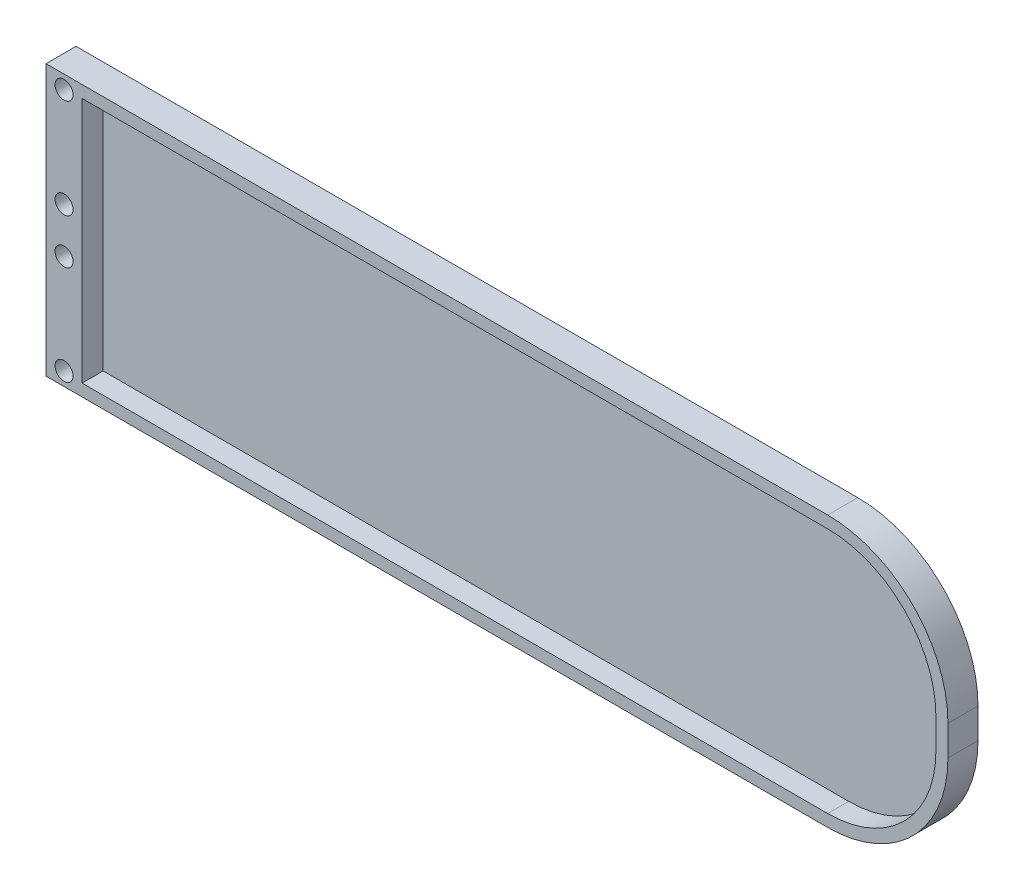
ISO-10303-21;
HEADER;
FILE_DESCRIPTION(('STEP AP214'),'2;1');
FILE_NAME('part.step','',(''),(''),'','','');
FILE_SCHEMA(('AUTOMOTIVE_DESIGN { 1 0 10303 214 1 1 1 1 }'));
ENDSEC;
DATA;
#1=APPLICATION_CONTEXT('core data for automotive mechanical design processes');
#2=APPLICATION_PROTOCOL_DEFINITION('international standard','automotive_design',2000,#1);
#3=PRODUCT_CONTEXT('',#1,'mechanical');
#4=PRODUCT('Part','Part','',(#3));
#5=PRODUCT_RELATED_PRODUCT_CATEGORY('part','',(#4));
#6=PRODUCT_DEFINITION_FORMATION('','',#4);
#7=PRODUCT_DEFINITION_CONTEXT('part definition',#1,'design');
#8=PRODUCT_DEFINITION('design','',#6,#7);
#9=PRODUCT_DEFINITION_SHAPE('','',#8);
#10=(LENGTH_UNIT() NAMED_UNIT(*) SI_UNIT(.MILLI.,.METRE.));
#11=(NAMED_UNIT(*) PLANE_ANGLE_UNIT() SI_UNIT($,.RADIAN.));
#12=(NAMED_UNIT(*) SI_UNIT($,.STERADIAN.) SOLID_ANGLE_UNIT());
#13=UNCERTAINTY_MEASURE_WITH_UNIT(LENGTH_MEASURE(1.E-05),#10,'distance_accuracy_value','');
#14=(GEOMETRIC_REPRESENTATION_CONTEXT(3) GLOBAL_UNCERTAINTY_ASSIGNED_CONTEXT((#13)) GLOBAL_UNIT_ASSIGNED_CONTEXT((#10,
#11,#12)) REPRESENTATION_CONTEXT('',''));
#15=CARTESIAN_POINT('',(0.,0.,0.));
#16=DIRECTION('',(0.,0.,1.));
#17=DIRECTION('',(1.,0.,0.));
#18=AXIS2_PLACEMENT_3D('',#15,#16,#17);
#19=CARTESIAN_POINT('',(-150.,0.,10.));
#20=DIRECTION('',(-1.,0.,0.));
#21=DIRECTION('',(0.,0.,1.));
#22=AXIS2_PLACEMENT_3D('',#19,#20,#21);
#23=PLANE('',#22);
#24=DIRECTION('',(0.,1.,0.));
#25=VECTOR('',#24,1.);
#26=CARTESIAN_POINT('',(-150.,0.,0.));
#27=LINE('',#26,#25);
#28=CARTESIAN_POINT('',(-150.,-45.,0.));
#29=VERTEX_POINT('',#28);
#30=CARTESIAN_POINT('',(-150.,45.,0.));
#31=VERTEX_POINT('',#30);
#32=EDGE_CURVE('E151',#29,#31,#27,.T.);
#33=ORIENTED_EDGE('',*,*,#32,.F.);
#34=DIRECTION('',(0.,0.,-1.));
#35=VECTOR('',#34,1.);
#36=CARTESIAN_POINT('',(-150.,-45.,10.));
#37=LINE('',#36,#35);
#38=CARTESIAN_POINT('',(-150.,-45.,10.));
#39=VERTEX_POINT('',#38);
#40=EDGE_CURVE('E138',#39,#29,#37,.T.);
#41=ORIENTED_EDGE('',*,*,#40,.F.);
#42=DIRECTION('',(0.,1.,0.));
#43=VECTOR('',#42,1.);
#44=CARTESIAN_POINT('',(-150.,0.,10.));
#45=LINE('',#44,#43);
#46=CARTESIAN_POINT('',(-150.,45.,10.));
#47=VERTEX_POINT('',#46);
#48=EDGE_CURVE('E183',#39,#47,#45,.T.);
#49=ORIENTED_EDGE('',*,*,#48,.T.);
#50=DIRECTION('',(0.,0.,-1.));
#51=VECTOR('',#50,1.);
#52=CARTESIAN_POINT('',(-150.,45.,10.));
#53=LINE('',#52,#51);
#54=EDGE_CURVE('E212',#47,#31,#53,.T.);
#55=ORIENTED_EDGE('',*,*,#54,.T.);
#56=EDGE_LOOP('',(#33,#41,#49,#55));
#57=FACE_BOUND('',#56,.T.);
#58=ADVANCED_FACE('F39',(#57),#23,.T.);
#59=CARTESIAN_POINT('',(-138.,0.,10.));
#60=DIRECTION('',(1.,0.,0.));
#61=DIRECTION('',(0.,0.,-1.));
#62=AXIS2_PLACEMENT_3D('',#59,#60,#61);
#63=PLANE('',#62);
#64=DIRECTION('',(0.,0.,-1.));
#65=VECTOR('',#64,1.);
#66=CARTESIAN_POINT('',(-138.,-40.9999999999999,10.));
#67=LINE('',#66,#65);
#68=CARTESIAN_POINT('',(-138.,-40.9999999999999,10.));
#69=VERTEX_POINT('',#68);
#70=CARTESIAN_POINT('',(-138.,-40.9999999999999,3.));
#71=VERTEX_POINT('',#70);
#72=EDGE_CURVE('E195',#69,#71,#67,.T.);
#73=ORIENTED_EDGE('',*,*,#72,.T.);
#74=DIRECTION('',(0.,1.,0.));
#75=VECTOR('',#74,1.);
#76=CARTESIAN_POINT('',(-138.,0.,3.));
#77=LINE('',#76,#75);
#78=CARTESIAN_POINT('',(-138.,41.,3.));
#79=VERTEX_POINT('',#78);
#80=EDGE_CURVE('E134',#71,#79,#77,.T.);
#81=ORIENTED_EDGE('',*,*,#80,.T.);
#82=DIRECTION('',(0.,0.,-1.));
#83=VECTOR('',#82,1.);
#84=CARTESIAN_POINT('',(-138.,41.,10.));
#85=LINE('',#84,#83);
#86=CARTESIAN_POINT('',(-138.,41.,10.));
#87=VERTEX_POINT('',#86);
#88=EDGE_CURVE('E128',#87,#79,#85,.T.);
#89=ORIENTED_EDGE('',*,*,#88,.F.);
#90=DIRECTION('',(0.,-1.,0.));
#91=VECTOR('',#90,1.);
#92=CARTESIAN_POINT('',(-138.,0.,10.));
#93=LINE('',#92,#91);
#94=EDGE_CURVE('E132',#87,#69,#93,.T.);
#95=ORIENTED_EDGE('',*,*,#94,.T.);
#96=EDGE_LOOP('',(#73,#81,#89,#95));
#97=FACE_BOUND('',#96,.T.);
#98=ADVANCED_FACE('F131',(#97),#63,.T.);
#99=CARTESIAN_POINT('',(0.,41.,10.));
#100=DIRECTION('',(0.,-1.,0.));
#101=DIRECTION('',(0.,0.,-1.));
#102=AXIS2_PLACEMENT_3D('',#99,#100,#101);
#103=PLANE('',#102);
#104=ORIENTED_EDGE('',*,*,#88,.T.);
#105=DIRECTION('',(1.,0.,0.));
#106=VECTOR('',#105,1.);
#107=CARTESIAN_POINT('',(0.,41.,3.));
#108=LINE('',#107,#106);
#109=CARTESIAN_POINT('',(110.,41.,3.));
#110=VERTEX_POINT('',#109);
#111=EDGE_CURVE('E233',#79,#110,#108,.T.);
#112=ORIENTED_EDGE('',*,*,#111,.T.);
#113=DIRECTION('',(0.,0.,-1.));
#114=VECTOR('',#113,1.);
#115=CARTESIAN_POINT('',(110.,41.,10.));
#116=LINE('',#115,#114);
#117=CARTESIAN_POINT('',(110.,41.,10.));
#118=VERTEX_POINT('',#117);
#119=EDGE_CURVE('E139',#118,#110,#116,.T.);
#120=ORIENTED_EDGE('',*,*,#119,.F.);
#121=DIRECTION('',(-1.,0.,0.));
#122=VECTOR('',#121,1.);
#123=CARTESIAN_POINT('',(0.,41.,10.));
#124=LINE('',#123,#122);
#125=EDGE_CURVE('E146',#118,#87,#124,.T.);
#126=ORIENTED_EDGE('',*,*,#125,.T.);
#127=EDGE_LOOP('',(#104,#112,#120,#126));
#128=FACE_BOUND('',#127,.T.);
#129=ADVANCED_FACE('F153',(#128),#103,.T.);
#130=CARTESIAN_POINT('',(110.,5.00000000000004,10.));
#131=DIRECTION('',(0.,0.,-1.));
#132=DIRECTION('',(-1.,0.,0.));
#133=AXIS2_PLACEMENT_3D('',#130,#131,#132);
#134=CYLINDRICAL_SURFACE('',#133,36.);
#135=ORIENTED_EDGE('',*,*,#119,.T.);
#136=CARTESIAN_POINT('',(110.,5.00000000000004,3.));
#137=DIRECTION('',(0.,0.,1.));
#138=DIRECTION('',(1.,0.,0.));
#139=AXIS2_PLACEMENT_3D('',#136,#137,#138);
#140=CIRCLE('',#139,36.);
#141=CARTESIAN_POINT('',(146.,5.00000000000004,3.));
#142=VERTEX_POINT('',#141);
#143=EDGE_CURVE('E231',#110,#142,#140,.F.);
#144=ORIENTED_EDGE('',*,*,#143,.T.);
#145=DIRECTION('',(0.,0.,-1.));
#146=VECTOR('',#145,1.);
#147=CARTESIAN_POINT('',(146.,5.00000000000004,10.));
#148=LINE('',#147,#146);
#149=CARTESIAN_POINT('',(146.,5.00000000000004,10.));
#150=VERTEX_POINT('',#149);
#151=EDGE_CURVE('E221',#150,#142,#148,.T.);
#152=ORIENTED_EDGE('',*,*,#151,.F.);
#153=CARTESIAN_POINT('',(110.,5.00000000000004,10.));
#154=DIRECTION('',(0.,0.,1.));
#155=DIRECTION('',(1.,0.,0.));
#156=AXIS2_PLACEMENT_3D('',#153,#154,#155);
#157=CIRCLE('',#156,36.);
#158=EDGE_CURVE('E155',#150,#118,#157,.T.);
#159=ORIENTED_EDGE('',*,*,#158,.T.);
#160=EDGE_LOOP('',(#135,#144,#152,#159));
#161=FACE_BOUND('',#160,.T.);
#162=ADVANCED_FACE('F317',(#161),#134,.F.);
#163=CARTESIAN_POINT('',(146.,0.,10.));
#164=DIRECTION('',(-1.,0.,0.));
#165=DIRECTION('',(0.,0.,1.));
#166=AXIS2_PLACEMENT_3D('',#163,#164,#165);
#167=PLANE('',#166);
#168=ORIENTED_EDGE('',*,*,#151,.T.);
#169=DIRECTION('',(0.,-1.,0.));
#170=VECTOR('',#169,1.);
#171=CARTESIAN_POINT('',(146.,0.,3.));
#172=LINE('',#171,#170);
#173=CARTESIAN_POINT('',(146.,-4.99999999999996,3.));
#174=VERTEX_POINT('',#173);
#175=EDGE_CURVE('E229',#142,#174,#172,.T.);
#176=ORIENTED_EDGE('',*,*,#175,.T.);
#177=DIRECTION('',(0.,0.,-1.));
#178=VECTOR('',#177,1.);
#179=CARTESIAN_POINT('',(146.,-4.99999999999996,10.));
#180=LINE('',#179,#178);
#181=CARTESIAN_POINT('',(146.,-4.99999999999996,10.));
#182=VERTEX_POINT('',#181);
#183=EDGE_CURVE('E218',#182,#174,#180,.T.);
#184=ORIENTED_EDGE('',*,*,#183,.F.);
#185=DIRECTION('',(0.,1.,0.));
#186=VECTOR('',#185,1.);
#187=CARTESIAN_POINT('',(146.,0.,10.));
#188=LINE('',#187,#186);
#189=EDGE_CURVE('E157',#182,#150,#188,.T.);
#190=ORIENTED_EDGE('',*,*,#189,.T.);
#191=EDGE_LOOP('',(#168,#176,#184,#190));
#192=FACE_BOUND('',#191,.T.);
#193=ADVANCED_FACE('F313',(#192),#167,.T.);
#194=CARTESIAN_POINT('',(110.,-4.99999999999995,10.));
#195=DIRECTION('',(0.,0.,-1.));
#196=DIRECTION('',(-1.,0.,0.));
#197=AXIS2_PLACEMENT_3D('',#194,#195,#196);
#198=CYLINDRICAL_SURFACE('',#197,36.);
#199=ORIENTED_EDGE('',*,*,#183,.T.);
#200=CARTESIAN_POINT('',(110.,-4.99999999999995,3.));
#201=DIRECTION('',(0.,0.,1.));
#202=DIRECTION('',(1.,0.,0.));
#203=AXIS2_PLACEMENT_3D('',#200,#201,#202);
#204=CIRCLE('',#203,36.);
#205=CARTESIAN_POINT('',(110.,-41.,3.));
#206=VERTEX_POINT('',#205);
#207=EDGE_CURVE('E227',#174,#206,#204,.F.);
#208=ORIENTED_EDGE('',*,*,#207,.T.);
#209=DIRECTION('',(0.,0.,-1.));
#210=VECTOR('',#209,1.);
#211=CARTESIAN_POINT('',(110.,-41.,10.));
#212=LINE('',#211,#210);
#213=CARTESIAN_POINT('',(110.,-41.,10.));
#214=VERTEX_POINT('',#213);
#215=EDGE_CURVE('E54',#214,#206,#212,.T.);
#216=ORIENTED_EDGE('',*,*,#215,.F.);
#217=CARTESIAN_POINT('',(110.,-4.99999999999995,10.));
#218=DIRECTION('',(0.,0.,1.));
#219=DIRECTION('',(1.,0.,0.));
#220=AXIS2_PLACEMENT_3D('',#217,#218,#219);
#221=CIRCLE('',#220,36.);
#222=EDGE_CURVE('E162',#214,#182,#221,.T.);
#223=ORIENTED_EDGE('',*,*,#222,.T.);
#224=EDGE_LOOP('',(#199,#208,#216,#223));
#225=FACE_BOUND('',#224,.T.);
#226=ADVANCED_FACE('F295',(#225),#198,.F.);
#227=CARTESIAN_POINT('',(-144.,40.5,10.));
#228=DIRECTION('',(0.,0.,-1.));
#229=DIRECTION('',(-1.,0.,0.));
#230=AXIS2_PLACEMENT_3D('',#227,#228,#229);
#231=CYLINDRICAL_SURFACE('',#230,2.99999999999999);
#232=CARTESIAN_POINT('',(-144.,40.5,10.));
#233=DIRECTION('',(0.,0.,1.));
#234=DIRECTION('',(1.,0.,0.));
#235=AXIS2_PLACEMENT_3D('',#232,#233,#234);
#236=CIRCLE('',#235,2.99999999999999);
#237=CARTESIAN_POINT('',(-141.,40.5,10.));
#238=VERTEX_POINT('',#237);
#239=EDGE_CURVE('E175',#238,#238,#236,.T.);
#240=ORIENTED_EDGE('',*,*,#239,.T.);
#241=EDGE_LOOP('',(#240));
#242=FACE_BOUND('',#241,.T.);
#243=CARTESIAN_POINT('',(-144.,40.5,0.));
#244=DIRECTION('',(0.,0.,1.));
#245=DIRECTION('',(1.,0.,0.));
#246=AXIS2_PLACEMENT_3D('',#243,#244,#245);
#247=CIRCLE('',#246,2.99999999999999);
#248=CARTESIAN_POINT('',(-141.,40.5,0.));
#249=VERTEX_POINT('',#248);
#250=EDGE_CURVE('E205',#249,#249,#247,.T.);
#251=ORIENTED_EDGE('',*,*,#250,.F.);
#252=EDGE_LOOP('',(#251));
#253=FACE_BOUND('',#252,.T.);
#254=ADVANCED_FACE('F291',(#242,#253),#231,.F.);
#255=CARTESIAN_POINT('',(-144.,7.50000000000003,10.));
#256=DIRECTION('',(0.,0.,-1.));
#257=DIRECTION('',(-1.,0.,0.));
#258=AXIS2_PLACEMENT_3D('',#255,#256,#257);
#259=CYLINDRICAL_SURFACE('',#258,2.99999999999999);
#260=CARTESIAN_POINT('',(-144.,7.50000000000003,10.));
#261=DIRECTION('',(0.,0.,1.));
#262=DIRECTION('',(1.,0.,0.));
#263=AXIS2_PLACEMENT_3D('',#260,#261,#262);
#264=CIRCLE('',#263,2.99999999999999);
#265=CARTESIAN_POINT('',(-141.,7.50000000000003,10.));
#266=VERTEX_POINT('',#265);
#267=EDGE_CURVE('E172',#266,#266,#264,.T.);
#268=ORIENTED_EDGE('',*,*,#267,.T.);
#269=EDGE_LOOP('',(#268));
#270=FACE_BOUND('',#269,.T.);
#271=CARTESIAN_POINT('',(-144.,7.50000000000003,0.));
#272=DIRECTION('',(0.,0.,1.));
#273=DIRECTION('',(1.,0.,0.));
#274=AXIS2_PLACEMENT_3D('',#271,#272,#273);
#275=CIRCLE('',#274,2.99999999999999);
#276=CARTESIAN_POINT('',(-141.,7.50000000000003,0.));
#277=VERTEX_POINT('',#276);
#278=EDGE_CURVE('E202',#277,#277,#275,.T.);
#279=ORIENTED_EDGE('',*,*,#278,.F.);
#280=EDGE_LOOP('',(#279));
#281=FACE_BOUND('',#280,.T.);
#282=ADVANCED_FACE('F294',(#270,#281),#259,.F.);
#283=CARTESIAN_POINT('',(-144.,-7.49999999999997,10.));
#284=DIRECTION('',(0.,0.,-1.));
#285=DIRECTION('',(-1.,0.,0.));
#286=AXIS2_PLACEMENT_3D('',#283,#284,#285);
#287=CYLINDRICAL_SURFACE('',#286,2.99999999999999);
#288=CARTESIAN_POINT('',(-144.,-7.49999999999997,10.));
#289=DIRECTION('',(0.,0.,1.));
#290=DIRECTION('',(1.,0.,0.));
#291=AXIS2_PLACEMENT_3D('',#288,#289,#290);
#292=CIRCLE('',#291,2.99999999999999);
#293=CARTESIAN_POINT('',(-141.,-7.49999999999997,10.));
#294=VERTEX_POINT('',#293);
#295=EDGE_CURVE('E169',#294,#294,#292,.T.);
#296=ORIENTED_EDGE('',*,*,#295,.T.);
#297=EDGE_LOOP('',(#296));
#298=FACE_BOUND('',#297,.T.);
#299=CARTESIAN_POINT('',(-144.,-7.49999999999997,0.));
#300=DIRECTION('',(0.,0.,1.));
#301=DIRECTION('',(1.,0.,0.));
#302=AXIS2_PLACEMENT_3D('',#299,#300,#301);
#303=CIRCLE('',#302,2.99999999999999);
#304=CARTESIAN_POINT('',(-141.,-7.49999999999997,0.));
#305=VERTEX_POINT('',#304);
#306=EDGE_CURVE('E199',#305,#305,#303,.T.);
#307=ORIENTED_EDGE('',*,*,#306,.F.);
#308=EDGE_LOOP('',(#307));
#309=FACE_BOUND('',#308,.T.);
#310=ADVANCED_FACE('F299',(#298,#309),#287,.F.);
#311=CARTESIAN_POINT('',(-144.,-40.5,10.));
#312=DIRECTION('',(0.,0.,-1.));
#313=DIRECTION('',(-1.,0.,0.));
#314=AXIS2_PLACEMENT_3D('',#311,#312,#313);
#315=CYLINDRICAL_SURFACE('',#314,2.99999999999999);
#316=CARTESIAN_POINT('',(-144.,-40.5,10.));
#317=DIRECTION('',(0.,0.,1.));
#318=DIRECTION('',(1.,0.,0.));
#319=AXIS2_PLACEMENT_3D('',#316,#317,#318);
#320=CIRCLE('',#319,2.99999999999999);
#321=CARTESIAN_POINT('',(-141.,-40.5,10.));
#322=VERTEX_POINT('',#321);
#323=EDGE_CURVE('E166',#322,#322,#320,.T.);
#324=ORIENTED_EDGE('',*,*,#323,.T.);
#325=EDGE_LOOP('',(#324));
#326=FACE_BOUND('',#325,.T.);
#327=CARTESIAN_POINT('',(-144.,-40.5,0.));
#328=DIRECTION('',(0.,0.,1.));
#329=DIRECTION('',(1.,0.,0.));
#330=AXIS2_PLACEMENT_3D('',#327,#328,#329);
#331=CIRCLE('',#330,2.99999999999999);
#332=CARTESIAN_POINT('',(-141.,-40.5,0.));
#333=VERTEX_POINT('',#332);
#334=EDGE_CURVE('E196',#333,#333,#331,.T.);
#335=ORIENTED_EDGE('',*,*,#334,.F.);
#336=EDGE_LOOP('',(#335));
#337=FACE_BOUND('',#336,.T.);
#338=ADVANCED_FACE('F303',(#326,#337),#315,.F.);
#339=CARTESIAN_POINT('',(0.,-40.9999999999999,10.));
#340=DIRECTION('',(0.,-1.,0.));
#341=DIRECTION('',(1.,0.,0.));
#342=AXIS2_PLACEMENT_3D('',#339,#340,#341);
#343=PLANE('',#342);
#344=DIRECTION('',(1.,0.,0.));
#345=VECTOR('',#344,1.);
#346=CARTESIAN_POINT('',(0.,-40.9999999999999,3.));
#347=LINE('',#346,#345);
#348=EDGE_CURVE('E215',#71,#206,#347,.T.);
#349=ORIENTED_EDGE('',*,*,#348,.F.);
#350=ORIENTED_EDGE('',*,*,#72,.F.);
#351=DIRECTION('',(-1.,0.,0.));
#352=VECTOR('',#351,1.);
#353=CARTESIAN_POINT('',(0.,-40.9999999999999,10.));
#354=LINE('',#353,#352);
#355=EDGE_CURVE('E149',#214,#69,#354,.T.);
#356=ORIENTED_EDGE('',*,*,#355,.F.);
#357=ORIENTED_EDGE('',*,*,#215,.T.);
#358=EDGE_LOOP('',(#349,#350,#356,#357));
#359=FACE_BOUND('',#358,.T.);
#360=ADVANCED_FACE('F307',(#359),#343,.F.);
#361=CARTESIAN_POINT('',(0.,0.,10.));
#362=DIRECTION('',(0.,0.,1.));
#363=DIRECTION('',(1.,0.,0.));
#364=AXIS2_PLACEMENT_3D('',#361,#362,#363);
#365=PLANE('',#364);
#366=ORIENTED_EDGE('',*,*,#94,.F.);
#367=ORIENTED_EDGE('',*,*,#125,.F.);
#368=ORIENTED_EDGE('',*,*,#158,.F.);
#369=ORIENTED_EDGE('',*,*,#189,.F.);
#370=ORIENTED_EDGE('',*,*,#222,.F.);
#371=ORIENTED_EDGE('',*,*,#355,.T.);
#372=EDGE_LOOP('',(#366,#367,#368,#369,#370,#371));
#373=FACE_BOUND('',#372,.T.);
#374=ORIENTED_EDGE('',*,*,#323,.F.);
#375=EDGE_LOOP('',(#374));
#376=FACE_BOUND('',#375,.T.);
#377=ORIENTED_EDGE('',*,*,#295,.F.);
#378=EDGE_LOOP('',(#377));
#379=FACE_BOUND('',#378,.T.);
#380=ORIENTED_EDGE('',*,*,#267,.F.);
#381=EDGE_LOOP('',(#380));
#382=FACE_BOUND('',#381,.T.);
#383=ORIENTED_EDGE('',*,*,#239,.F.);
#384=EDGE_LOOP('',(#383));
#385=FACE_BOUND('',#384,.T.);
#386=CARTESIAN_POINT('',(110.,5.00000000000004,10.));
#387=DIRECTION('',(0.,0.,1.));
#388=DIRECTION('',(1.,0.,0.));
#389=AXIS2_PLACEMENT_3D('',#386,#387,#388);
#390=CIRCLE('',#389,40.);
#391=CARTESIAN_POINT('',(150.,5.00000000000004,10.));
#392=VERTEX_POINT('',#391);
#393=CARTESIAN_POINT('',(110.,45.0000000000001,10.));
#394=VERTEX_POINT('',#393);
#395=EDGE_CURVE('E178',#392,#394,#390,.T.);
#396=ORIENTED_EDGE('',*,*,#395,.T.);
#397=DIRECTION('',(-1.,0.,0.));
#398=VECTOR('',#397,1.);
#399=CARTESIAN_POINT('',(0.,45.,10.));
#400=LINE('',#399,#398);
#401=EDGE_CURVE('E181',#394,#47,#400,.T.);
#402=ORIENTED_EDGE('',*,*,#401,.T.);
#403=ORIENTED_EDGE('',*,*,#48,.F.);
#404=DIRECTION('',(-1.,0.,0.));
#405=VECTOR('',#404,1.);
#406=CARTESIAN_POINT('',(0.,-45.,10.));
#407=LINE('',#406,#405);
#408=CARTESIAN_POINT('',(110.,-45.,10.));
#409=VERTEX_POINT('',#408);
#410=EDGE_CURVE('E186',#409,#39,#407,.T.);
#411=ORIENTED_EDGE('',*,*,#410,.F.);
#412=CARTESIAN_POINT('',(110.,-4.99999999999995,10.));
#413=DIRECTION('',(0.,0.,1.));
#414=DIRECTION('',(1.,0.,0.));
#415=AXIS2_PLACEMENT_3D('',#412,#413,#414);
#416=CIRCLE('',#415,40.);
#417=CARTESIAN_POINT('',(150.,-4.99999999999995,10.));
#418=VERTEX_POINT('',#417);
#419=EDGE_CURVE('E189',#409,#418,#416,.T.);
#420=ORIENTED_EDGE('',*,*,#419,.T.);
#421=DIRECTION('',(0.,1.,0.));
#422=VECTOR('',#421,1.);
#423=CARTESIAN_POINT('',(150.,4.16333634234434E-13,10.));
#424=LINE('',#423,#422);
#425=EDGE_CURVE('E192',#418,#392,#424,.T.);
#426=ORIENTED_EDGE('',*,*,#425,.T.);
#427=EDGE_LOOP('',(#396,#402,#403,#411,#420,#426));
#428=FACE_BOUND('',#427,.T.);
#429=ADVANCED_FACE('F143',(#373,#376,#379,#382,#385,#428),#365,.T.);
#430=CARTESIAN_POINT('',(150.,4.16333634234434E-13,3.));
#431=DIRECTION('',(-1.,0.,0.));
#432=DIRECTION('',(0.,-1.,0.));
#433=AXIS2_PLACEMENT_3D('',#430,#431,#432);
#434=PLANE('',#433);
#435=DIRECTION('',(0.,1.,0.));
#436=VECTOR('',#435,1.);
#437=CARTESIAN_POINT('',(150.,4.16333634234434E-13,0.));
#438=LINE('',#437,#436);
#439=CARTESIAN_POINT('',(150.,-4.99999999999995,0.));
#440=VERTEX_POINT('',#439);
#441=CARTESIAN_POINT('',(150.,5.00000000000004,0.));
#442=VERTEX_POINT('',#441);
#443=EDGE_CURVE('E242',#440,#442,#438,.T.);
#444=ORIENTED_EDGE('',*,*,#443,.T.);
#445=DIRECTION('',(0.,0.,-1.));
#446=VECTOR('',#445,1.);
#447=CARTESIAN_POINT('',(150.,5.00000000000004,3.));
#448=LINE('',#447,#446);
#449=EDGE_CURVE('E247',#392,#442,#448,.T.);
#450=ORIENTED_EDGE('',*,*,#449,.F.);
#451=ORIENTED_EDGE('',*,*,#425,.F.);
#452=DIRECTION('',(0.,0.,-1.));
#453=VECTOR('',#452,1.);
#454=CARTESIAN_POINT('',(150.,-4.99999999999995,3.));
#455=LINE('',#454,#453);
#456=EDGE_CURVE('E47',#418,#440,#455,.T.);
#457=ORIENTED_EDGE('',*,*,#456,.T.);
#458=EDGE_LOOP('',(#444,#450,#451,#457));
#459=FACE_BOUND('',#458,.T.);
#460=ADVANCED_FACE('F252',(#459),#434,.F.);
#461=CARTESIAN_POINT('',(110.,-4.99999999999995,3.));
#462=DIRECTION('',(0.,0.,-1.));
#463=DIRECTION('',(-1.,0.,0.));
#464=AXIS2_PLACEMENT_3D('',#461,#462,#463);
#465=CYLINDRICAL_SURFACE('',#464,40.);
#466=CARTESIAN_POINT('',(110.,-4.99999999999995,0.));
#467=DIRECTION('',(0.,0.,1.));
#468=DIRECTION('',(1.,0.,0.));
#469=AXIS2_PLACEMENT_3D('',#466,#467,#468);
#470=CIRCLE('',#469,40.);
#471=CARTESIAN_POINT('',(110.,-45.,0.));
#472=VERTEX_POINT('',#471);
#473=EDGE_CURVE('E240',#472,#440,#470,.T.);
#474=ORIENTED_EDGE('',*,*,#473,.T.);
#475=ORIENTED_EDGE('',*,*,#456,.F.);
#476=ORIENTED_EDGE('',*,*,#419,.F.);
#477=DIRECTION('',(0.,0.,-1.));
#478=VECTOR('',#477,1.);
#479=CARTESIAN_POINT('',(110.,-45.,3.));
#480=LINE('',#479,#478);
#481=EDGE_CURVE('E11',#409,#472,#480,.T.);
#482=ORIENTED_EDGE('',*,*,#481,.T.);
#483=EDGE_LOOP('',(#474,#475,#476,#482));
#484=FACE_BOUND('',#483,.T.);
#485=ADVANCED_FACE('F271',(#484),#465,.T.);
#486=CARTESIAN_POINT('',(0.,-45.,3.));
#487=DIRECTION('',(0.,-1.,0.));
#488=DIRECTION('',(1.,0.,0.));
#489=AXIS2_PLACEMENT_3D('',#486,#487,#488);
#490=PLANE('',#489);
#491=ORIENTED_EDGE('',*,*,#40,.T.);
#492=DIRECTION('',(-1.,0.,0.));
#493=VECTOR('',#492,1.);
#494=CARTESIAN_POINT('',(0.,-45.,0.));
#495=LINE('',#494,#493);
#496=EDGE_CURVE('E238',#472,#29,#495,.T.);
#497=ORIENTED_EDGE('',*,*,#496,.F.);
#498=ORIENTED_EDGE('',*,*,#481,.F.);
#499=ORIENTED_EDGE('',*,*,#410,.T.);
#500=EDGE_LOOP('',(#491,#497,#498,#499));
#501=FACE_BOUND('',#500,.T.);
#502=ADVANCED_FACE('F270',(#501),#490,.T.);
#503=CARTESIAN_POINT('',(0.,45.,3.));
#504=DIRECTION('',(0.,-1.,0.));
#505=DIRECTION('',(1.,0.,0.));
#506=AXIS2_PLACEMENT_3D('',#503,#504,#505);
#507=PLANE('',#506);
#508=DIRECTION('',(-1.,0.,0.));
#509=VECTOR('',#508,1.);
#510=CARTESIAN_POINT('',(0.,45.,0.));
#511=LINE('',#510,#509);
#512=CARTESIAN_POINT('',(110.,45.0000000000001,0.));
#513=VERTEX_POINT('',#512);
#514=EDGE_CURVE('E236',#513,#31,#511,.T.);
#515=ORIENTED_EDGE('',*,*,#514,.T.);
#516=ORIENTED_EDGE('',*,*,#54,.F.);
#517=ORIENTED_EDGE('',*,*,#401,.F.);
#518=DIRECTION('',(0.,0.,-1.));
#519=VECTOR('',#518,1.);
#520=CARTESIAN_POINT('',(110.,45.0000000000001,3.));
#521=LINE('',#520,#519);
#522=EDGE_CURVE('E245',#394,#513,#521,.T.);
#523=ORIENTED_EDGE('',*,*,#522,.T.);
#524=EDGE_LOOP('',(#515,#516,#517,#523));
#525=FACE_BOUND('',#524,.T.);
#526=ADVANCED_FACE('F41',(#525),#507,.F.);
#527=CARTESIAN_POINT('',(110.,5.00000000000004,3.));
#528=DIRECTION('',(0.,0.,-1.));
#529=DIRECTION('',(-1.,0.,0.));
#530=AXIS2_PLACEMENT_3D('',#527,#528,#529);
#531=CYLINDRICAL_SURFACE('',#530,40.);
#532=CARTESIAN_POINT('',(110.,5.00000000000004,0.));
#533=DIRECTION('',(0.,0.,1.));
#534=DIRECTION('',(1.,0.,0.));
#535=AXIS2_PLACEMENT_3D('',#532,#533,#534);
#536=CIRCLE('',#535,40.);
#537=EDGE_CURVE('E62',#442,#513,#536,.T.);
#538=ORIENTED_EDGE('',*,*,#537,.T.);
#539=ORIENTED_EDGE('',*,*,#522,.F.);
#540=ORIENTED_EDGE('',*,*,#395,.F.);
#541=ORIENTED_EDGE('',*,*,#449,.T.);
#542=EDGE_LOOP('',(#538,#539,#540,#541));
#543=FACE_BOUND('',#542,.T.);
#544=ADVANCED_FACE('F273',(#543),#531,.T.);
#545=CARTESIAN_POINT('',(0.,0.,0.));
#546=DIRECTION('',(0.,0.,1.));
#547=DIRECTION('',(1.,0.,0.));
#548=AXIS2_PLACEMENT_3D('',#545,#546,#547);
#549=PLANE('',#548);
#550=ORIENTED_EDGE('',*,*,#496,.T.);
#551=ORIENTED_EDGE('',*,*,#32,.T.);
#552=ORIENTED_EDGE('',*,*,#514,.F.);
#553=ORIENTED_EDGE('',*,*,#537,.F.);
#554=ORIENTED_EDGE('',*,*,#443,.F.);
#555=ORIENTED_EDGE('',*,*,#473,.F.);
#556=EDGE_LOOP('',(#550,#551,#552,#553,#554,#555));
#557=FACE_BOUND('',#556,.T.);
#558=ORIENTED_EDGE('',*,*,#334,.T.);
#559=EDGE_LOOP('',(#558));
#560=FACE_BOUND('',#559,.T.);
#561=ORIENTED_EDGE('',*,*,#306,.T.);
#562=EDGE_LOOP('',(#561));
#563=FACE_BOUND('',#562,.T.);
#564=ORIENTED_EDGE('',*,*,#278,.T.);
#565=EDGE_LOOP('',(#564));
#566=FACE_BOUND('',#565,.T.);
#567=ORIENTED_EDGE('',*,*,#250,.T.);
#568=EDGE_LOOP('',(#567));
#569=FACE_BOUND('',#568,.T.);
#570=ADVANCED_FACE('F257',(#557,#560,#563,#566,#569),#549,.F.);
#571=CARTESIAN_POINT('',(0.,0.,3.));
#572=DIRECTION('',(0.,0.,1.));
#573=DIRECTION('',(1.,0.,0.));
#574=AXIS2_PLACEMENT_3D('',#571,#572,#573);
#575=PLANE('',#574);
#576=ORIENTED_EDGE('',*,*,#111,.F.);
#577=ORIENTED_EDGE('',*,*,#80,.F.);
#578=ORIENTED_EDGE('',*,*,#348,.T.);
#579=ORIENTED_EDGE('',*,*,#207,.F.);
#580=ORIENTED_EDGE('',*,*,#175,.F.);
#581=ORIENTED_EDGE('',*,*,#143,.F.);
#582=EDGE_LOOP('',(#576,#577,#578,#579,#580,#581));
#583=FACE_BOUND('',#582,.T.);
#584=ADVANCED_FACE('F280',(#583),#575,.T.);
#585=CLOSED_SHELL('',(#58,#98,#129,#162,#193,#226,#254,#282,#310,#338,#360,#429,#460,#485,#502,
#526,#544,#570,#584));
#586=MANIFOLD_SOLID_BREP('B2',#585);
#587=ADVANCED_BREP_SHAPE_REPRESENTATION('',(#18,#586),#14);
#588=SHAPE_DEFINITION_REPRESENTATION(#9,#587);
ENDSEC;
END-ISO-10303-21;
